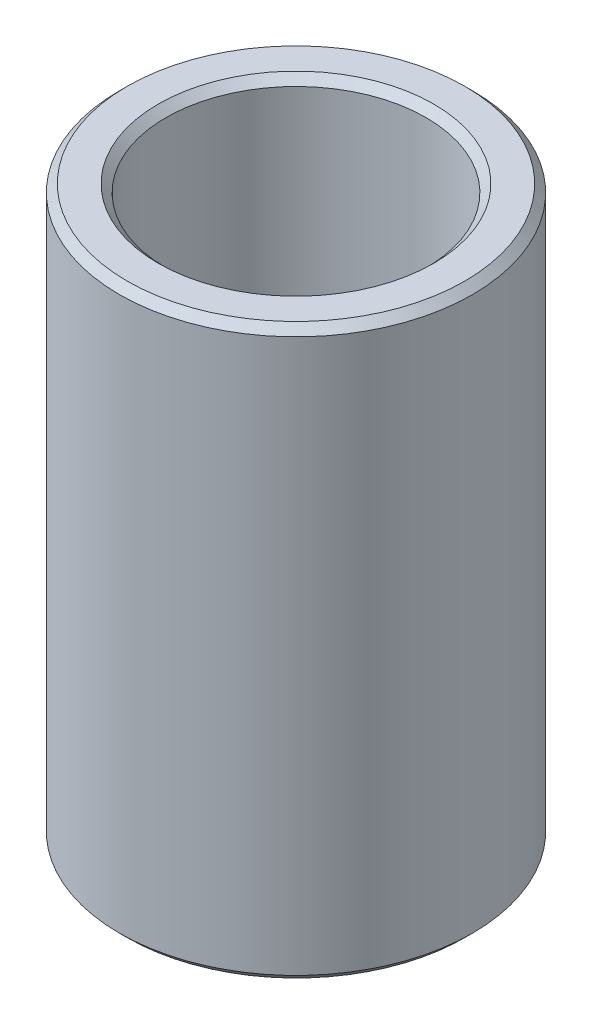
ISO-10303-21;
HEADER;
FILE_DESCRIPTION(('STEP AP214'),'2;1');
FILE_NAME('part.step','',(''),(''),'','','');
FILE_SCHEMA(('AUTOMOTIVE_DESIGN { 1 0 10303 214 1 1 1 1 }'));
ENDSEC;
DATA;
#1=APPLICATION_CONTEXT('core data for automotive mechanical design processes');
#2=APPLICATION_PROTOCOL_DEFINITION('international standard','automotive_design',2000,#1);
#3=PRODUCT_CONTEXT('',#1,'mechanical');
#4=PRODUCT('Part','Part','',(#3));
#5=PRODUCT_RELATED_PRODUCT_CATEGORY('part','',(#4));
#6=PRODUCT_DEFINITION_FORMATION('','',#4);
#7=PRODUCT_DEFINITION_CONTEXT('part definition',#1,'design');
#8=PRODUCT_DEFINITION('design','',#6,#7);
#9=PRODUCT_DEFINITION_SHAPE('','',#8);
#10=(LENGTH_UNIT() NAMED_UNIT(*) SI_UNIT(.MILLI.,.METRE.));
#11=(NAMED_UNIT(*) PLANE_ANGLE_UNIT() SI_UNIT($,.RADIAN.));
#12=(NAMED_UNIT(*) SI_UNIT($,.STERADIAN.) SOLID_ANGLE_UNIT());
#13=UNCERTAINTY_MEASURE_WITH_UNIT(LENGTH_MEASURE(1.E-05),#10,'distance_accuracy_value','');
#14=(GEOMETRIC_REPRESENTATION_CONTEXT(3) GLOBAL_UNCERTAINTY_ASSIGNED_CONTEXT((#13)) GLOBAL_UNIT_ASSIGNED_CONTEXT((#10,
#11,#12)) REPRESENTATION_CONTEXT('',''));
#15=CARTESIAN_POINT('',(0.,0.,0.));
#16=DIRECTION('',(0.,0.,1.));
#17=DIRECTION('',(1.,0.,0.));
#18=AXIS2_PLACEMENT_3D('',#15,#16,#17);
#19=CARTESIAN_POINT('',(0.,185.18411941218,0.));
#20=DIRECTION('',(0.,-1.,0.));
#21=DIRECTION('',(0.,0.,-1.));
#22=AXIS2_PLACEMENT_3D('',#19,#20,#21);
#23=CYLINDRICAL_SURFACE('',#22,57.5);
#24=CARTESIAN_POINT('',(0.,2.53458786663471,0.));
#25=DIRECTION('',(0.,1.,0.));
#26=DIRECTION('',(0.,0.,1.));
#27=AXIS2_PLACEMENT_3D('',#24,#25,#26);
#28=CIRCLE('',#27,57.5);
#29=CARTESIAN_POINT('',(0.,2.53458786663469,-57.5));
#30=VERTEX_POINT('',#29);
#31=EDGE_CURVE('E10',#30,#30,#28,.T.);
#32=CARTESIAN_POINT('',(0.,182.649531545545,0.));
#33=DIRECTION('',(0.,1.,0.));
#34=DIRECTION('',(0.,0.,1.));
#35=AXIS2_PLACEMENT_3D('',#32,#33,#34);
#36=CIRCLE('',#35,57.5);
#37=CARTESIAN_POINT('',(0.,182.649531545545,-57.5));
#38=VERTEX_POINT('',#37);
#39=EDGE_CURVE('E50',#38,#38,#36,.F.);
#40=CARTESIAN_POINT('',(0.,2.53458786663469,-57.5));
#41=CARTESIAN_POINT('',(0.,4.41078519662334,-57.5));
#42=CARTESIAN_POINT('',(0.,6.28698252661199,-57.5));
#43=CARTESIAN_POINT('',(0.,10.0393771865893,-57.5));
#44=CARTESIAN_POINT('',(0.,11.9155745165779,-57.5));
#45=CARTESIAN_POINT('',(0.,15.6679691765553,-57.5));
#46=CARTESIAN_POINT('',(0.,17.5441665065439,-57.5));
#47=CARTESIAN_POINT('',(0.,21.2965611665212,-57.5));
#48=CARTESIAN_POINT('',(0.,23.1727584965099,-57.5));
#49=CARTESIAN_POINT('',(0.,26.9251531564872,-57.5));
#50=CARTESIAN_POINT('',(0.,28.8013504864758,-57.5));
#51=CARTESIAN_POINT('',(0.,32.5537451464531,-57.5));
#52=CARTESIAN_POINT('',(0.,34.4299424764418,-57.5));
#53=CARTESIAN_POINT('',(0.,38.1823371364191,-57.5));
#54=CARTESIAN_POINT('',(0.,40.0585344664077,-57.5));
#55=CARTESIAN_POINT('',(0.,43.810929126385,-57.5));
#56=CARTESIAN_POINT('',(0.,45.6871264563737,-57.5));
#57=CARTESIAN_POINT('',(0.,49.439521116351,-57.5));
#58=CARTESIAN_POINT('',(0.,51.3157184463397,-57.5));
#59=CARTESIAN_POINT('',(0.,55.068113106317,-57.5));
#60=CARTESIAN_POINT('',(0.,56.9443104363056,-57.5));
#61=CARTESIAN_POINT('',(0.,60.6967050962829,-57.5));
#62=CARTESIAN_POINT('',(0.,62.5729024262716,-57.5));
#63=CARTESIAN_POINT('',(0.,66.3252970862489,-57.5));
#64=CARTESIAN_POINT('',(0.,68.2014944162375,-57.5));
#65=CARTESIAN_POINT('',(0.,71.9538890762148,-57.5));
#66=CARTESIAN_POINT('',(0.,73.8300864062035,-57.5));
#67=CARTESIAN_POINT('',(0.,77.5824810661808,-57.5));
#68=CARTESIAN_POINT('',(0.,79.4586783961694,-57.5));
#69=CARTESIAN_POINT('',(0.,83.2110730561467,-57.5));
#70=CARTESIAN_POINT('',(0.,85.0872703861354,-57.5));
#71=CARTESIAN_POINT('',(0.,88.8396650461127,-57.5));
#72=CARTESIAN_POINT('',(0.,90.7158623761014,-57.5));
#73=CARTESIAN_POINT('',(0.,94.4682570360787,-57.5));
#74=CARTESIAN_POINT('',(0.,96.3444543660673,-57.5));
#75=CARTESIAN_POINT('',(0.,100.096849026045,-57.5));
#76=CARTESIAN_POINT('',(0.,101.973046356033,-57.5));
#77=CARTESIAN_POINT('',(0.,105.725441016011,-57.5));
#78=CARTESIAN_POINT('',(0.,107.601638345999,-57.5));
#79=CARTESIAN_POINT('',(0.,111.354033005977,-57.5));
#80=CARTESIAN_POINT('',(0.,113.230230335965,-57.5));
#81=CARTESIAN_POINT('',(0.,116.982624995943,-57.5));
#82=CARTESIAN_POINT('',(0.,118.858822325931,-57.5));
#83=CARTESIAN_POINT('',(0.,122.611216985908,-57.5));
#84=CARTESIAN_POINT('',(0.,124.487414315897,-57.5));
#85=CARTESIAN_POINT('',(0.,128.239808975874,-57.5));
#86=CARTESIAN_POINT('',(0.,130.116006305863,-57.5));
#87=CARTESIAN_POINT('',(0.,133.86840096584,-57.5));
#88=CARTESIAN_POINT('',(0.,135.744598295829,-57.5));
#89=CARTESIAN_POINT('',(0.,139.496992955806,-57.5));
#90=CARTESIAN_POINT('',(0.,141.373190285795,-57.5));
#91=CARTESIAN_POINT('',(0.,145.125584945772,-57.5));
#92=CARTESIAN_POINT('',(0.,147.001782275761,-57.5));
#93=CARTESIAN_POINT('',(0.,150.754176935738,-57.5));
#94=CARTESIAN_POINT('',(0.,152.630374265727,-57.5));
#95=CARTESIAN_POINT('',(0.,156.382768925704,-57.5));
#96=CARTESIAN_POINT('',(0.,158.258966255693,-57.5));
#97=CARTESIAN_POINT('',(0.,162.01136091567,-57.5));
#98=CARTESIAN_POINT('',(0.,163.887558245659,-57.5));
#99=CARTESIAN_POINT('',(0.,167.639952905636,-57.5));
#100=CARTESIAN_POINT('',(0.,169.516150235625,-57.5));
#101=CARTESIAN_POINT('',(0.,173.268544895602,-57.5));
#102=CARTESIAN_POINT('',(0.,175.144742225591,-57.5));
#103=CARTESIAN_POINT('',(0.,178.897136885568,-57.5));
#104=CARTESIAN_POINT('',(0.,180.773334215557,-57.5));
#105=CARTESIAN_POINT('',(0.,182.649531545545,-57.5));
#106=B_SPLINE_CURVE_WITH_KNOTS('',3,(#40,#41,#42,#43,#44,#45,#46,#47,#48,#49,#50,#51,#52,#53,
#54,#55,#56,#57,#58,#59,#60,#61,#62,#63,#64,#65,#66,#67,#68,#69,#70,#71,#72,#73,#74,#75,#76,#77,
#78,#79,#80,#81,#82,#83,#84,#85,#86,#87,#88,#89,#90,#91,#92,#93,#94,#95,#96,#97,#98,#99,#100,
#101,#102,#103,#104,#105),.UNSPECIFIED.,.F.,.F.,(4,2,2,2,2,2,2,2,2,2,2,2,2,2,2,2,2,2,2,2,2,2,2,
2,2,2,2,2,2,2,2,2,4),(0.,5.62859198996596,11.2571839799319,16.8857759698979,22.5143679598638,
28.1429599498298,33.7715519397957,39.4001439297617,45.0287359197277,50.6573279096936,
56.2859198996596,61.9145118896255,67.5431038795915,73.1716958695575,78.8002878595234,
84.4288798494894,90.0574718394553,95.6860638294213,101.314655819387,106.943247809353,
112.571839799319,118.200431789285,123.829023779251,129.457615769217,135.086207759183,
140.714799749149,146.343391739115,151.971983729081,157.600575719047,163.229167709013,
168.857759698979,174.486351688945,180.114943678911),.UNSPECIFIED.);
#107=EDGE_CURVE('BSEAM39',#30,#38,#106,.T.);
#108=ORIENTED_EDGE('',*,*,#31,.T.);
#109=ORIENTED_EDGE('',*,*,#39,.T.);
#110=ORIENTED_EDGE('',*,*,#107,.T.);
#111=ORIENTED_EDGE('',*,*,#107,.F.);
#112=EDGE_LOOP('',(#108,#110,#109,#111));
#113=FACE_BOUND('',#112,.T.);
#114=ADVANCED_FACE('F39',(#113),#23,.T.);
#115=CARTESIAN_POINT('',(0.,185.18411941218,0.));
#116=DIRECTION('',(0.,1.,0.));
#117=DIRECTION('',(0.,0.,1.));
#118=AXIS2_PLACEMENT_3D('',#115,#116,#117);
#119=PLANE('',#118);
#120=CARTESIAN_POINT('',(0.,185.18411941218,0.));
#121=DIRECTION('',(0.,1.,0.));
#122=DIRECTION('',(0.,0.,1.));
#123=AXIS2_PLACEMENT_3D('',#120,#121,#122);
#124=CIRCLE('',#123,44.8936592671102);
#125=CARTESIAN_POINT('',(0.,185.18411941218,44.8936592671102));
#126=VERTEX_POINT('',#125);
#127=EDGE_CURVE('E58',#126,#126,#124,.F.);
#128=ORIENTED_EDGE('',*,*,#127,.T.);
#129=EDGE_LOOP('',(#128));
#130=FACE_BOUND('',#129,.T.);
#131=CARTESIAN_POINT('',(0.,185.18411941218,0.));
#132=DIRECTION('',(0.,1.,0.));
#133=DIRECTION('',(0.,0.,1.));
#134=AXIS2_PLACEMENT_3D('',#131,#132,#133);
#135=CIRCLE('',#134,54.9654121333656);
#136=CARTESIAN_POINT('',(0.,185.18411941218,54.9654121333656));
#137=VERTEX_POINT('',#136);
#138=EDGE_CURVE('E61',#137,#137,#135,.T.);
#139=ORIENTED_EDGE('',*,*,#138,.T.);
#140=EDGE_LOOP('',(#139));
#141=FACE_BOUND('',#140,.T.);
#142=ADVANCED_FACE('F88',(#130,#141),#119,.T.);
#143=CARTESIAN_POINT('',(0.,0.,0.));
#144=DIRECTION('',(0.,1.,0.));
#145=DIRECTION('',(0.,0.,1.));
#146=AXIS2_PLACEMENT_3D('',#143,#144,#145);
#147=PLANE('',#146);
#148=CARTESIAN_POINT('',(0.,0.,0.));
#149=DIRECTION('',(0.,1.,0.));
#150=DIRECTION('',(0.,0.,1.));
#151=AXIS2_PLACEMENT_3D('',#148,#149,#150);
#152=CIRCLE('',#151,44.8936592671101);
#153=CARTESIAN_POINT('',(0.,0.,44.8936592671101));
#154=VERTEX_POINT('',#153);
#155=EDGE_CURVE('E51',#154,#154,#152,.T.);
#156=ORIENTED_EDGE('',*,*,#155,.T.);
#157=EDGE_LOOP('',(#156));
#158=FACE_BOUND('',#157,.T.);
#159=CARTESIAN_POINT('',(0.,0.,0.));
#160=DIRECTION('',(0.,1.,0.));
#161=DIRECTION('',(0.,0.,1.));
#162=AXIS2_PLACEMENT_3D('',#159,#160,#161);
#163=CIRCLE('',#162,54.9654121333653);
#164=CARTESIAN_POINT('',(0.,0.,54.9654121333653));
#165=VERTEX_POINT('',#164);
#166=EDGE_CURVE('E54',#165,#165,#163,.F.);
#167=ORIENTED_EDGE('',*,*,#166,.T.);
#168=EDGE_LOOP('',(#167));
#169=FACE_BOUND('',#168,.T.);
#170=ADVANCED_FACE('F83',(#158,#169),#147,.F.);
#171=CARTESIAN_POINT('',(0.,185.18411941218,0.));
#172=DIRECTION('',(0.,-1.,0.));
#173=DIRECTION('',(0.,0.,-1.));
#174=AXIS2_PLACEMENT_3D('',#171,#172,#173);
#175=CYLINDRICAL_SURFACE('',#174,42.3590714004755);
#176=CARTESIAN_POINT('',(0.,182.649531545545,0.));
#177=DIRECTION('',(0.,1.,0.));
#178=DIRECTION('',(0.,0.,1.));
#179=AXIS2_PLACEMENT_3D('',#176,#177,#178);
#180=CIRCLE('',#179,42.3590714004755);
#181=CARTESIAN_POINT('',(0.,182.649531545545,-42.3590714004755));
#182=VERTEX_POINT('',#181);
#183=EDGE_CURVE('E67',#182,#182,#180,.T.);
#184=CARTESIAN_POINT('',(0.,2.53458786663457,0.));
#185=DIRECTION('',(0.,1.,0.));
#186=DIRECTION('',(0.,0.,1.));
#187=AXIS2_PLACEMENT_3D('',#184,#185,#186);
#188=CIRCLE('',#187,42.3590714004755);
#189=CARTESIAN_POINT('',(0.,2.53458786663457,-42.3590714004755));
#190=VERTEX_POINT('',#189);
#191=EDGE_CURVE('E69',#190,#190,#188,.F.);
#192=CARTESIAN_POINT('',(0.,182.649531545545,-42.3590714004755));
#193=CARTESIAN_POINT('',(0.,180.773334215556,-42.3590714004755));
#194=CARTESIAN_POINT('',(0.,178.897136885568,-42.3590714004755));
#195=CARTESIAN_POINT('',(0.,175.14474222559,-42.3590714004755));
#196=CARTESIAN_POINT('',(0.,173.268544895602,-42.3590714004755));
#197=CARTESIAN_POINT('',(0.,169.516150235625,-42.3590714004755));
#198=CARTESIAN_POINT('',(0.,167.639952905636,-42.3590714004755));
#199=CARTESIAN_POINT('',(0.,163.887558245659,-42.3590714004755));
#200=CARTESIAN_POINT('',(0.,162.01136091567,-42.3590714004755));
#201=CARTESIAN_POINT('',(0.,158.258966255693,-42.3590714004755));
#202=CARTESIAN_POINT('',(0.,156.382768925704,-42.3590714004755));
#203=CARTESIAN_POINT('',(0.,152.630374265727,-42.3590714004755));
#204=CARTESIAN_POINT('',(0.,150.754176935738,-42.3590714004755));
#205=CARTESIAN_POINT('',(0.,147.001782275761,-42.3590714004755));
#206=CARTESIAN_POINT('',(0.,145.125584945772,-42.3590714004755));
#207=CARTESIAN_POINT('',(0.,141.373190285795,-42.3590714004755));
#208=CARTESIAN_POINT('',(0.,139.496992955806,-42.3590714004755));
#209=CARTESIAN_POINT('',(0.,135.744598295829,-42.3590714004755));
#210=CARTESIAN_POINT('',(0.,133.86840096584,-42.3590714004755));
#211=CARTESIAN_POINT('',(0.,130.116006305863,-42.3590714004755));
#212=CARTESIAN_POINT('',(0.,128.239808975874,-42.3590714004755));
#213=CARTESIAN_POINT('',(0.,124.487414315897,-42.3590714004755));
#214=CARTESIAN_POINT('',(0.,122.611216985908,-42.3590714004755));
#215=CARTESIAN_POINT('',(0.,118.858822325931,-42.3590714004755));
#216=CARTESIAN_POINT('',(0.,116.982624995942,-42.3590714004755));
#217=CARTESIAN_POINT('',(0.,113.230230335965,-42.3590714004755));
#218=CARTESIAN_POINT('',(0.,111.354033005976,-42.3590714004755));
#219=CARTESIAN_POINT('',(0.,107.601638345999,-42.3590714004755));
#220=CARTESIAN_POINT('',(0.,105.72544101601,-42.3590714004755));
#221=CARTESIAN_POINT('',(0.,101.973046356033,-42.3590714004755));
#222=CARTESIAN_POINT('',(0.,100.096849026044,-42.3590714004755));
#223=CARTESIAN_POINT('',(0.,96.3444543660671,-42.3590714004755));
#224=CARTESIAN_POINT('',(0.,94.4682570360785,-42.3590714004755));
#225=CARTESIAN_POINT('',(0.,90.7158623761012,-42.3590714004755));
#226=CARTESIAN_POINT('',(0.,88.8396650461125,-42.3590714004755));
#227=CARTESIAN_POINT('',(0.,85.0872703861352,-42.3590714004755));
#228=CARTESIAN_POINT('',(0.,83.2110730561466,-42.3590714004755));
#229=CARTESIAN_POINT('',(0.,79.4586783961693,-42.3590714004755));
#230=CARTESIAN_POINT('',(0.,77.5824810661806,-42.3590714004755));
#231=CARTESIAN_POINT('',(0.,73.8300864062033,-42.3590714004755));
#232=CARTESIAN_POINT('',(0.,71.9538890762147,-42.3590714004755));
#233=CARTESIAN_POINT('',(0.,68.2014944162374,-42.3590714004755));
#234=CARTESIAN_POINT('',(0.,66.3252970862487,-42.3590714004755));
#235=CARTESIAN_POINT('',(0.,62.5729024262714,-42.3590714004755));
#236=CARTESIAN_POINT('',(0.,60.6967050962828,-42.3590714004755));
#237=CARTESIAN_POINT('',(0.,56.9443104363055,-42.3590714004755));
#238=CARTESIAN_POINT('',(0.,55.0681131063168,-42.3590714004755));
#239=CARTESIAN_POINT('',(0.,51.3157184463395,-42.3590714004755));
#240=CARTESIAN_POINT('',(0.,49.4395211163508,-42.3590714004755));
#241=CARTESIAN_POINT('',(0.,45.6871264563735,-42.3590714004755));
#242=CARTESIAN_POINT('',(0.,43.8109291263849,-42.3590714004755));
#243=CARTESIAN_POINT('',(0.,40.0585344664076,-42.3590714004755));
#244=CARTESIAN_POINT('',(0.,38.182337136419,-42.3590714004755));
#245=CARTESIAN_POINT('',(0.,34.4299424764416,-42.3590714004755));
#246=CARTESIAN_POINT('',(0.,32.553745146453,-42.3590714004755));
#247=CARTESIAN_POINT('',(0.,28.8013504864757,-42.3590714004755));
#248=CARTESIAN_POINT('',(0.,26.925153156487,-42.3590714004755));
#249=CARTESIAN_POINT('',(0.,23.1727584965097,-42.3590714004755));
#250=CARTESIAN_POINT('',(0.,21.2965611665211,-42.3590714004755));
#251=CARTESIAN_POINT('',(0.,17.5441665065438,-42.3590714004755));
#252=CARTESIAN_POINT('',(0.,15.6679691765551,-42.3590714004755));
#253=CARTESIAN_POINT('',(0.,11.9155745165778,-42.3590714004755));
#254=CARTESIAN_POINT('',(0.,10.0393771865892,-42.3590714004755));
#255=CARTESIAN_POINT('',(0.,6.28698252661188,-42.3590714004755));
#256=CARTESIAN_POINT('',(0.,4.41078519662323,-42.3590714004755));
#257=CARTESIAN_POINT('',(0.,2.53458786663457,-42.3590714004755));
#258=B_SPLINE_CURVE_WITH_KNOTS('',3,(#192,#193,#194,#195,#196,#197,#198,#199,#200,#201,#202,
#203,#204,#205,#206,#207,#208,#209,#210,#211,#212,#213,#214,#215,#216,#217,#218,#219,#220,#221,
#222,#223,#224,#225,#226,#227,#228,#229,#230,#231,#232,#233,#234,#235,#236,#237,#238,#239,#240,
#241,#242,#243,#244,#245,#246,#247,#248,#249,#250,#251,#252,#253,#254,#255,#256,#257),
.UNSPECIFIED.,.F.,.F.,(4,2,2,2,2,2,2,2,2,2,2,2,2,2,2,2,2,2,2,2,2,2,2,2,2,2,2,2,2,2,2,2,4),(0.,
5.62859198996593,11.2571839799319,16.8857759698978,22.5143679598638,28.1429599498297,
33.7715519397957,39.4001439297617,45.0287359197276,50.6573279096935,56.2859198996595,
61.9145118896255,67.5431038795914,73.1716958695574,78.8002878595233,84.4288798494893,
90.0574718394552,95.6860638294212,101.314655819387,106.943247809353,112.571839799319,
118.200431789285,123.829023779251,129.457615769217,135.086207759183,140.714799749149,
146.343391739115,151.971983729081,157.600575719047,163.229167709013,168.857759698979,
174.486351688945,180.11494367891),.UNSPECIFIED.);
#259=EDGE_CURVE('BSEAM71',#182,#190,#258,.T.);
#260=ORIENTED_EDGE('',*,*,#183,.T.);
#261=ORIENTED_EDGE('',*,*,#191,.T.);
#262=ORIENTED_EDGE('',*,*,#259,.T.);
#263=ORIENTED_EDGE('',*,*,#259,.F.);
#264=EDGE_LOOP('',(#260,#262,#261,#263));
#265=FACE_BOUND('',#264,.T.);
#266=ADVANCED_FACE('F71',(#265),#175,.F.);
#267=CARTESIAN_POINT('',(0.,182.649531545545,0.));
#268=DIRECTION('',(0.,1.,0.));
#269=DIRECTION('',(0.,0.,1.));
#270=AXIS2_PLACEMENT_3D('',#267,#268,#269);
#271=CONICAL_SURFACE('',#270,42.3590714004755,0.785398163397447);
#272=ORIENTED_EDGE('',*,*,#127,.F.);
#273=EDGE_LOOP('',(#272));
#274=FACE_BOUND('',#273,.T.);
#275=ORIENTED_EDGE('',*,*,#183,.F.);
#276=EDGE_LOOP('',(#275));
#277=FACE_BOUND('',#276,.T.);
#278=ADVANCED_FACE('F77',(#274,#277),#271,.F.);
#279=CARTESIAN_POINT('',(0.,0.,0.));
#280=DIRECTION('',(0.,-1.,0.));
#281=DIRECTION('',(0.,0.,-1.));
#282=AXIS2_PLACEMENT_3D('',#279,#280,#281);
#283=CONICAL_SURFACE('',#282,44.8936592671101,0.785398163397442);
#284=ORIENTED_EDGE('',*,*,#191,.F.);
#285=EDGE_LOOP('',(#284));
#286=FACE_BOUND('',#285,.T.);
#287=ORIENTED_EDGE('',*,*,#155,.F.);
#288=EDGE_LOOP('',(#287));
#289=FACE_BOUND('',#288,.T.);
#290=ADVANCED_FACE('F73',(#286,#289),#283,.F.);
#291=CARTESIAN_POINT('',(0.,2.53458786663471,0.));
#292=DIRECTION('',(0.,1.,0.));
#293=DIRECTION('',(0.,0.,1.));
#294=AXIS2_PLACEMENT_3D('',#291,#292,#293);
#295=CONICAL_SURFACE('',#294,57.5,0.785398163397454);
#296=ORIENTED_EDGE('',*,*,#166,.F.);
#297=EDGE_LOOP('',(#296));
#298=FACE_BOUND('',#297,.T.);
#299=ORIENTED_EDGE('',*,*,#31,.F.);
#300=EDGE_LOOP('',(#299));
#301=FACE_BOUND('',#300,.T.);
#302=ADVANCED_FACE('F76',(#298,#301),#295,.T.);
#303=CARTESIAN_POINT('',(0.,185.18411941218,0.));
#304=DIRECTION('',(0.,-1.,0.));
#305=DIRECTION('',(0.,0.,-1.));
#306=AXIS2_PLACEMENT_3D('',#303,#304,#305);
#307=CONICAL_SURFACE('',#306,54.9654121333656,0.785398163397446);
#308=ORIENTED_EDGE('',*,*,#39,.F.);
#309=EDGE_LOOP('',(#308));
#310=FACE_BOUND('',#309,.T.);
#311=ORIENTED_EDGE('',*,*,#138,.F.);
#312=EDGE_LOOP('',(#311));
#313=FACE_BOUND('',#312,.T.);
#314=ADVANCED_FACE('F45',(#310,#313),#307,.T.);
#315=CLOSED_SHELL('',(#114,#142,#170,#266,#278,#290,#302,#314));
#316=MANIFOLD_SOLID_BREP('B2',#315);
#317=ADVANCED_BREP_SHAPE_REPRESENTATION('',(#18,#316),#14);
#318=SHAPE_DEFINITION_REPRESENTATION(#9,#317);
ENDSEC;
END-ISO-10303-21;
